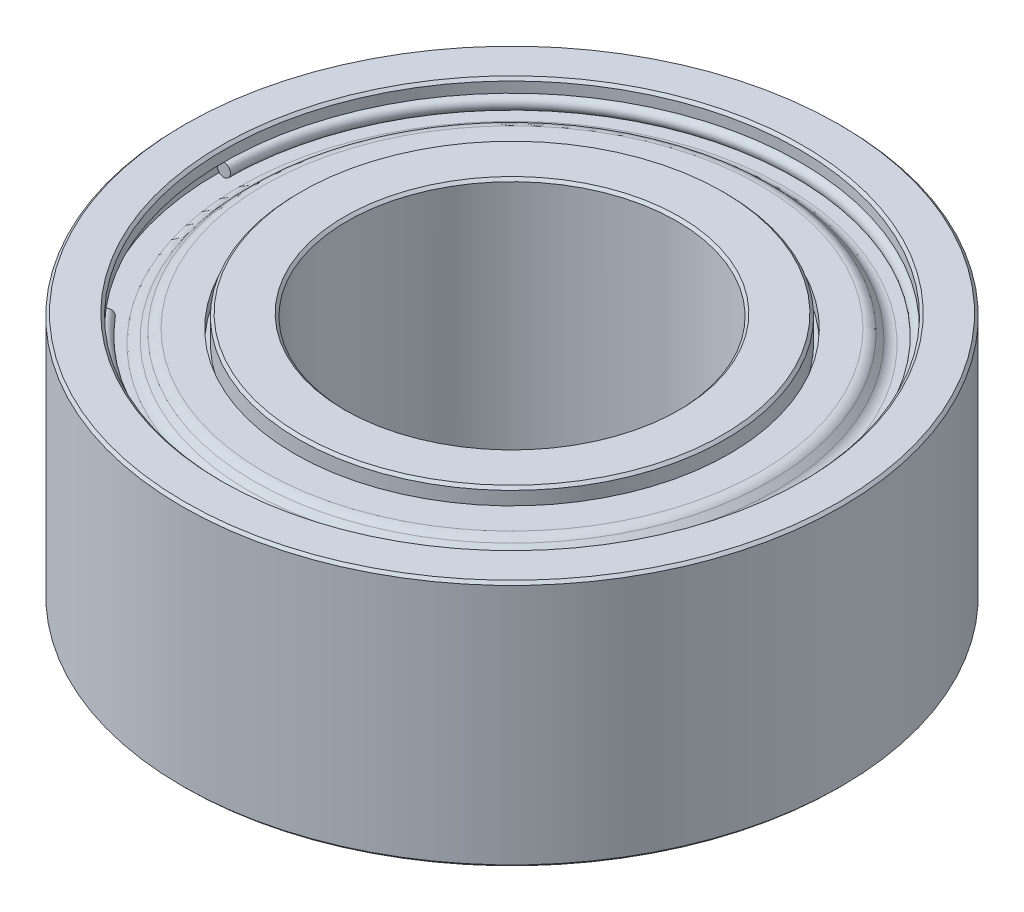
ISO-10303-21;
HEADER;
FILE_DESCRIPTION(('STEP AP214'),'2;1');
FILE_NAME('part.step','',(''),(''),'','','');
FILE_SCHEMA(('AUTOMOTIVE_DESIGN { 1 0 10303 214 1 1 1 1 }'));
ENDSEC;
DATA;
#1=APPLICATION_CONTEXT('core data for automotive mechanical design processes');
#2=APPLICATION_PROTOCOL_DEFINITION('international standard','automotive_design',2000,#1);
#3=PRODUCT_CONTEXT('',#1,'mechanical');
#4=PRODUCT('Part','Part','',(#3));
#5=PRODUCT_RELATED_PRODUCT_CATEGORY('part','',(#4));
#6=PRODUCT_DEFINITION_FORMATION('','',#4);
#7=PRODUCT_DEFINITION_CONTEXT('part definition',#1,'design');
#8=PRODUCT_DEFINITION('design','',#6,#7);
#9=PRODUCT_DEFINITION_SHAPE('','',#8);
#10=(LENGTH_UNIT() NAMED_UNIT(*) SI_UNIT(.MILLI.,.METRE.));
#11=(NAMED_UNIT(*) PLANE_ANGLE_UNIT() SI_UNIT($,.RADIAN.));
#12=(NAMED_UNIT(*) SI_UNIT($,.STERADIAN.) SOLID_ANGLE_UNIT());
#13=UNCERTAINTY_MEASURE_WITH_UNIT(LENGTH_MEASURE(1.E-05),#10,'distance_accuracy_value','');
#14=(GEOMETRIC_REPRESENTATION_CONTEXT(3) GLOBAL_UNCERTAINTY_ASSIGNED_CONTEXT((#13)) GLOBAL_UNIT_ASSIGNED_CONTEXT((#10,
#11,#12)) REPRESENTATION_CONTEXT('',''));
#15=CARTESIAN_POINT('',(0.,0.,0.));
#16=DIRECTION('',(0.,0.,1.));
#17=DIRECTION('',(1.,0.,0.));
#18=AXIS2_PLACEMENT_3D('',#15,#16,#17);
#19=CARTESIAN_POINT('',(0.,0.,0.));
#20=DIRECTION('',(0.,0.,1.));
#21=DIRECTION('',(1.,0.,0.));
#22=AXIS2_PLACEMENT_3D('',#19,#20,#21);
#23=PLANE('',#22);
#24=CARTESIAN_POINT('',(-5.4229,-2.00025,0.));
#25=CARTESIAN_POINT('',(-5.42290899992696,-2.01448035707391,0.));
#26=CARTESIAN_POINT('',(-5.42533449231307,-2.02879828029162,0.));
#27=CARTESIAN_POINT('',(-5.43478379429475,-2.05577713981076,0.));
#28=CARTESIAN_POINT('',(-5.44180760389031,-2.06843807611218,0.));
#29=CARTESIAN_POINT('',(-5.45965126434134,-2.0907338982527,0.));
#30=CARTESIAN_POINT('',(-5.47047111519689,-2.10036878409172,0.));
#31=CARTESIAN_POINT('',(-5.49468979269764,-2.11551068307499,0.));
#32=CARTESIAN_POINT('',(-5.50808861934284,-2.12101769621925,0.));
#33=CARTESIAN_POINT('',(-5.53595386450994,-2.12728686264336,0.));
#34=CARTESIAN_POINT('',(-5.55042028303185,-2.12804901592321,0.));
#35=CARTESIAN_POINT('',(-5.57879001376165,-2.12474255040931,0.));
#36=CARTESIAN_POINT('',(-5.59269332596954,-2.12067393161555,0.));
#37=CARTESIAN_POINT('',(-5.61836899590066,-2.10816068190603,0.));
#38=CARTESIAN_POINT('',(-5.6301413536239,-2.09971605099026,0.));
#39=CARTESIAN_POINT('',(-5.65022901054135,-2.07941861413728,0.));
#40=CARTESIAN_POINT('',(-5.65854430973557,-2.06756580820007,0.));
#41=CARTESIAN_POINT('',(-5.67077615792845,-2.0417292051199,0.));
#42=CARTESIAN_POINT('',(-5.6746927069271,-2.02774540797694,0.));
#43=CARTESIAN_POINT('',(-5.67666833023764,-2.00916030553464,0.));
#44=CARTESIAN_POINT('',(-5.67690282036117,-2.00470945246293,0.));
#45=CARTESIAN_POINT('',(-5.67689100007304,-1.98601964292609,0.));
#46=CARTESIAN_POINT('',(-5.67446550768693,-1.97170171970838,0.));
#47=CARTESIAN_POINT('',(-5.66501620570525,-1.94472286018924,0.));
#48=CARTESIAN_POINT('',(-5.65799239610969,-1.93206192388782,0.));
#49=CARTESIAN_POINT('',(-5.64014873565866,-1.9097661017473,0.));
#50=CARTESIAN_POINT('',(-5.62932888480311,-1.90013121590828,0.));
#51=CARTESIAN_POINT('',(-5.60511020730236,-1.884989316925,0.));
#52=CARTESIAN_POINT('',(-5.59171138065716,-1.87948230378075,0.));
#53=CARTESIAN_POINT('',(-5.56384613549006,-1.87321313735664,0.));
#54=CARTESIAN_POINT('',(-5.54937971696815,-1.87245098407679,0.));
#55=CARTESIAN_POINT('',(-5.52100998623835,-1.87575744959069,0.));
#56=CARTESIAN_POINT('',(-5.50710667403046,-1.87982606838444,0.));
#57=CARTESIAN_POINT('',(-5.48143100409934,-1.89233931809397,0.));
#58=CARTESIAN_POINT('',(-5.4696586463761,-1.90078394900974,0.));
#59=CARTESIAN_POINT('',(-5.44957098945865,-1.92108138586272,0.));
#60=CARTESIAN_POINT('',(-5.44125569026443,-1.93293419179993,0.));
#61=CARTESIAN_POINT('',(-5.42902384207155,-1.9587707948801,0.));
#62=CARTESIAN_POINT('',(-5.4251072930729,-1.97275459202306,0.));
#63=CARTESIAN_POINT('',(-5.42313166976236,-1.99133969446536,0.));
#64=CARTESIAN_POINT('',(-5.42289717963883,-1.99579054753707,0.));
#65=CARTESIAN_POINT('',(-5.4229,-2.00025,0.));
#66=B_SPLINE_CURVE_WITH_KNOTS('',3,(#24,#25,#26,#27,#28,#29,#30,#31,#32,#33,#34,#35,#36,#37,#38,
#39,#40,#41,#42,#43,#44,#45,#46,#47,#48,#49,#50,#51,#52,#53,#54,#55,#56,#57,#58,#59,#60,#61,#62,
#63,#64,#65),.UNSPECIFIED.,.T.,.F.,(4,2,2,2,2,2,2,2,2,2,2,2,2,2,2,2,2,2,2,2,4),(0.,
0.0426429642402333,0.0852859284804666,0.127928892721776,0.170571856963085,0.213214821204395,
0.255857785445704,0.298500749687012,0.341143713928322,0.383786678169631,0.397149959984692,
0.439792924224925,0.482435888465158,0.525078852706467,0.567721816947776,0.610364781189086,
0.653007745430394,0.695650709671705,0.738293673913014,0.780936638154323,0.794299919969383),.UNSPECIFIED.);
#67=CARTESIAN_POINT('',(-5.4229,-2.00025,0.));
#68=VERTEX_POINT('',#67);
#69=EDGE_CURVE('P0_E19',#68,#68,#66,.T.);
#70=ORIENTED_EDGE('',*,*,#69,.F.);
#71=EDGE_LOOP('',(#70));
#72=FACE_BOUND('',#71,.T.);
#73=ADVANCED_FACE('P0_F15',(#72),#23,.T.);
#74=CARTESIAN_POINT('',(0.,0.,0.));
#75=DIRECTION('',(0.64278760968653,0.,0.766044443118986));
#76=DIRECTION('',(0.766044443118986,0.,-0.64278760968653));
#77=AXIS2_PLACEMENT_3D('',#74,#75,#76);
#78=PLANE('',#77);
#79=CARTESIAN_POINT('',(-4.34875769914217,-2.00025,3.64904098142946));
#80=CARTESIAN_POINT('',(-4.34875080479814,-2.01448035707391,3.64903519638793));
#81=CARTESIAN_POINT('',(-4.34689276983393,-2.02879828029162,3.64747611993474));
#82=CARTESIAN_POINT('',(-4.33965418455951,-2.05577713981076,3.64140222570073));
#83=CARTESIAN_POINT('',(-4.3342736342493,-2.06843807611218,3.63688740791991));
#84=CARTESIAN_POINT('',(-4.32060459731589,-2.0907338982527,3.62541772407054));
#85=CARTESIAN_POINT('',(-4.31231611069262,-2.10036878409172,3.61846285800193));
#86=CARTESIAN_POINT('',(-4.29376352737348,-2.11551068307499,3.60289539218145));
#87=CARTESIAN_POINT('',(-4.28349943067761,-2.12101769621925,3.59428279242959));
#88=CARTESIAN_POINT('',(-4.2621534144612,-2.12728686264336,3.57637135809529));
#89=CARTESIAN_POINT('',(-4.25107149494066,-2.12804901592321,3.56707252351287));
#90=CARTESIAN_POINT('',(-4.22933902036231,-2.12474255040931,3.54883681210961));
#91=CARTESIAN_POINT('',(-4.21868846530451,-2.12067393161555,3.53989993528878));
#92=CARTESIAN_POINT('',(-4.19901976103042,-2.10816068190603,3.52339593278665));
#93=CARTESIAN_POINT('',(-4.19000161181413,-2.09971605099026,3.51582880710536));
#94=CARTESIAN_POINT('',(-4.17461357385723,-2.07941861413728,3.50291671013118));
#95=CARTESIAN_POINT('',(-4.16824368511663,-2.06756580820007,3.4975717388383));
#96=CARTESIAN_POINT('',(-4.1588735457794,-2.0417292051199,3.48970925837636));
#97=CARTESIAN_POINT('',(-4.15587329518277,-2.02774540797694,3.48719174920729));
#98=CARTESIAN_POINT('',(-4.15435987992404,-2.00916030553464,3.48592184302187));
#99=CARTESIAN_POINT('',(-4.15418025006795,-2.00470945246293,3.48577111567587));
#100=CARTESIAN_POINT('',(-4.15418930493398,-1.98601964292609,3.48577871361062));
#101=CARTESIAN_POINT('',(-4.15604733989819,-1.97170171970838,3.4873377900638));
#102=CARTESIAN_POINT('',(-4.16328592517261,-1.94472286018924,3.49341168429781));
#103=CARTESIAN_POINT('',(-4.16866647548282,-1.93206192388782,3.49792650207864));
#104=CARTESIAN_POINT('',(-4.18233551241623,-1.9097661017473,3.50939618592801));
#105=CARTESIAN_POINT('',(-4.1906239990395,-1.90013121590828,3.51635105199662));
#106=CARTESIAN_POINT('',(-4.20917658235864,-1.884989316925,3.5319185178171));
#107=CARTESIAN_POINT('',(-4.2194406790545,-1.87948230378075,3.54053111756896));
#108=CARTESIAN_POINT('',(-4.24078669527091,-1.87321313735664,3.55844255190326));
#109=CARTESIAN_POINT('',(-4.25186861479146,-1.87245098407679,3.56774138648568));
#110=CARTESIAN_POINT('',(-4.2736010893698,-1.87575744959069,3.58597709788894));
#111=CARTESIAN_POINT('',(-4.28425164442761,-1.87982606838444,3.59491397470977));
#112=CARTESIAN_POINT('',(-4.3039203487017,-1.89233931809397,3.6114179772119));
#113=CARTESIAN_POINT('',(-4.31293849791799,-1.90078394900974,3.61898510289319));
#114=CARTESIAN_POINT('',(-4.32832653587489,-1.92108138586272,3.63189719986736));
#115=CARTESIAN_POINT('',(-4.33469642461549,-1.93293419179993,3.63724217116024));
#116=CARTESIAN_POINT('',(-4.34406656395272,-1.9587707948801,3.64510465162219));
#117=CARTESIAN_POINT('',(-4.34706681454934,-1.97275459202306,3.64762216079126));
#118=CARTESIAN_POINT('',(-4.34858022980807,-1.99133969446536,3.64889206697668));
#119=CARTESIAN_POINT('',(-4.34875985966417,-1.99579054753707,3.64904279432267));
#120=CARTESIAN_POINT('',(-4.34875769914217,-2.00025,3.64904098142946));
#121=B_SPLINE_CURVE_WITH_KNOTS('',3,(#79,#80,#81,#82,#83,#84,#85,#86,#87,#88,#89,#90,#91,#92,
#93,#94,#95,#96,#97,#98,#99,#100,#101,#102,#103,#104,#105,#106,#107,#108,#109,#110,#111,#112,
#113,#114,#115,#116,#117,#118,#119,#120),.UNSPECIFIED.,.T.,.F.,(4,2,2,2,2,2,2,2,2,2,2,2,2,2,2,2,
2,2,2,2,4),(0.,0.0426429642402328,0.0852859284804664,0.127928892721775,0.170571856963085,
0.213214821204396,0.255857785445703,0.298500749687012,0.341143713928322,0.383786678169631,
0.397149959984692,0.439792924224925,0.482435888465158,0.525078852706467,0.567721816947776,
0.610364781189086,0.653007745430396,0.695650709671705,0.738293673913013,0.780936638154323,
0.794299919969383),.UNSPECIFIED.);
#122=CARTESIAN_POINT('',(-4.34875769914217,-2.00025,3.64904098142946));
#123=VERTEX_POINT('',#122);
#124=EDGE_CURVE('P0_E10',#123,#123,#121,.T.);
#125=ORIENTED_EDGE('',*,*,#124,.F.);
#126=EDGE_LOOP('',(#125));
#127=FACE_BOUND('',#126,.T.);
#128=ADVANCED_FACE('P0_F35',(#127),#78,.F.);
#129=CARTESIAN_POINT('',(0.,-2.00025,0.));
#130=DIRECTION('',(0.,-1.,0.));
#131=DIRECTION('',(0.,0.,1.));
#132=AXIS2_PLACEMENT_3D('',#129,#130,#131);
#133=TOROIDAL_SURFACE('',#132,5.5499,0.127000000000001);
#134=ORIENTED_EDGE('',*,*,#124,.T.);
#135=EDGE_LOOP('',(#134));
#136=FACE_BOUND('',#135,.T.);
#137=ORIENTED_EDGE('',*,*,#69,.T.);
#138=EDGE_LOOP('',(#137));
#139=FACE_BOUND('',#138,.T.);
#140=ADVANCED_FACE('P0_F37',(#136,#139),#133,.T.);
#141=CLOSED_SHELL('',(#73,#128,#140));
#142=MANIFOLD_SOLID_BREP('P0_B1',#141);
#143=CARTESIAN_POINT('',(0.,0.,0.));
#144=DIRECTION('',(0.64278760968653,0.,0.766044443118986));
#145=DIRECTION('',(0.766044443118986,0.,-0.64278760968653));
#146=AXIS2_PLACEMENT_3D('',#143,#144,#145);
#147=PLANE('',#146);
#148=CARTESIAN_POINT('',(-4.15418241058994,2.00025,3.48577292856909));
#149=CARTESIAN_POINT('',(-4.15418930493398,2.01448035707391,3.48577871361062));
#150=CARTESIAN_POINT('',(-4.15604733989819,2.02879828029162,3.48733779006381));
#151=CARTESIAN_POINT('',(-4.16328592517261,2.05577713981076,3.49341168429782));
#152=CARTESIAN_POINT('',(-4.16866647548281,2.06843807611218,3.49792650207864));
#153=CARTESIAN_POINT('',(-4.18233551241622,2.0907338982527,3.50939618592801));
#154=CARTESIAN_POINT('',(-4.1906239990395,2.10036878409172,3.51635105199662));
#155=CARTESIAN_POINT('',(-4.20917658235864,2.11551068307499,3.5319185178171));
#156=CARTESIAN_POINT('',(-4.2194406790545,2.12101769621925,3.54053111756897));
#157=CARTESIAN_POINT('',(-4.24078669527091,2.12728686264336,3.55844255190326));
#158=CARTESIAN_POINT('',(-4.25186861479146,2.12804901592321,3.56774138648568));
#159=CARTESIAN_POINT('',(-4.2736010893698,2.12474255040931,3.58597709788894));
#160=CARTESIAN_POINT('',(-4.2842516444276,2.12067393161555,3.59491397470978));
#161=CARTESIAN_POINT('',(-4.3039203487017,2.10816068190603,3.6114179772119));
#162=CARTESIAN_POINT('',(-4.31293849791799,2.09971605099026,3.61898510289319));
#163=CARTESIAN_POINT('',(-4.32832653587489,2.07941861413728,3.63189719986737));
#164=CARTESIAN_POINT('',(-4.33469642461549,2.06756580820007,3.63724217116025));
#165=CARTESIAN_POINT('',(-4.34406656395272,2.0417292051199,3.64510465162219));
#166=CARTESIAN_POINT('',(-4.34706681454934,2.02774540797693,3.64762216079126));
#167=CARTESIAN_POINT('',(-4.34858022980807,2.00916030553464,3.64889206697668));
#168=CARTESIAN_POINT('',(-4.34875985966417,2.00470945246293,3.64904279432268));
#169=CARTESIAN_POINT('',(-4.34875080479814,1.98601964292609,3.64903519638793));
#170=CARTESIAN_POINT('',(-4.34689276983392,1.97170171970838,3.64747611993475));
#171=CARTESIAN_POINT('',(-4.3396541845595,1.94472286018924,3.64140222570074));
#172=CARTESIAN_POINT('',(-4.3342736342493,1.93206192388782,3.63688740791991));
#173=CARTESIAN_POINT('',(-4.32060459731589,1.9097661017473,3.62541772407054));
#174=CARTESIAN_POINT('',(-4.31231611069261,1.90013121590828,3.61846285800193));
#175=CARTESIAN_POINT('',(-4.29376352737347,1.884989316925,3.60289539218146));
#176=CARTESIAN_POINT('',(-4.28349943067761,1.87948230378075,3.59428279242959));
#177=CARTESIAN_POINT('',(-4.2621534144612,1.87321313735664,3.5763713580953));
#178=CARTESIAN_POINT('',(-4.25107149494066,1.87245098407679,3.56707252351287));
#179=CARTESIAN_POINT('',(-4.22933902036231,1.87575744959069,3.54883681210961));
#180=CARTESIAN_POINT('',(-4.21868846530451,1.87982606838444,3.53989993528878));
#181=CARTESIAN_POINT('',(-4.19901976103042,1.89233931809397,3.52339593278665));
#182=CARTESIAN_POINT('',(-4.19000161181412,1.90078394900974,3.51582880710536));
#183=CARTESIAN_POINT('',(-4.17461357385723,1.92108138586272,3.50291671013119));
#184=CARTESIAN_POINT('',(-4.16824368511663,1.93293419179993,3.49757173883831));
#185=CARTESIAN_POINT('',(-4.1588735457794,1.9587707948801,3.48970925837636));
#186=CARTESIAN_POINT('',(-4.15587329518277,1.97275459202306,3.48719174920729));
#187=CARTESIAN_POINT('',(-4.15435987992404,1.99133969446536,3.48592184302187));
#188=CARTESIAN_POINT('',(-4.15418025006795,1.99579054753707,3.48577111567587));
#189=CARTESIAN_POINT('',(-4.15418241058994,2.00025,3.48577292856909));
#190=B_SPLINE_CURVE_WITH_KNOTS('',3,(#148,#149,#150,#151,#152,#153,#154,#155,#156,#157,#158,
#159,#160,#161,#162,#163,#164,#165,#166,#167,#168,#169,#170,#171,#172,#173,#174,#175,#176,#177,
#178,#179,#180,#181,#182,#183,#184,#185,#186,#187,#188,#189),.UNSPECIFIED.,.T.,.F.,(4,2,2,2,2,2,
2,2,2,2,2,2,2,2,2,2,2,2,2,2,4),(0.,0.0426429642402334,0.0852859284804667,0.127928892721777,
0.170571856963085,0.213214821204394,0.255857785445703,0.298500749687013,0.341143713928323,
0.383786678169631,0.397149959984691,0.439792924224925,0.482435888465158,0.525078852706467,
0.567721816947776,0.610364781189085,0.653007745430396,0.695650709671704,0.738293673913014,
0.780936638154323,0.794299919969383),.UNSPECIFIED.);
#191=CARTESIAN_POINT('',(-4.15418241058994,2.00025,3.48577292856909));
#192=VERTEX_POINT('',#191);
#193=EDGE_CURVE('P1_E19',#192,#192,#190,.T.);
#194=ORIENTED_EDGE('',*,*,#193,.F.);
#195=EDGE_LOOP('',(#194));
#196=FACE_BOUND('',#195,.T.);
#197=ADVANCED_FACE('P1_F15',(#196),#147,.F.);
#198=CARTESIAN_POINT('',(0.,0.,0.));
#199=DIRECTION('',(0.,0.,1.));
#200=DIRECTION('',(1.,0.,0.));
#201=AXIS2_PLACEMENT_3D('',#198,#199,#200);
#202=PLANE('',#201);
#203=CARTESIAN_POINT('',(-5.6769,2.00025,0.));
#204=CARTESIAN_POINT('',(-5.67689100007304,2.01448035707391,0.));
#205=CARTESIAN_POINT('',(-5.67446550768693,2.02879828029162,0.));
#206=CARTESIAN_POINT('',(-5.66501620570525,2.05577713981076,0.));
#207=CARTESIAN_POINT('',(-5.65799239610969,2.06843807611218,0.));
#208=CARTESIAN_POINT('',(-5.64014873565866,2.0907338982527,0.));
#209=CARTESIAN_POINT('',(-5.62932888480311,2.10036878409172,0.));
#210=CARTESIAN_POINT('',(-5.60511020730236,2.11551068307499,0.));
#211=CARTESIAN_POINT('',(-5.59171138065716,2.12101769621925,0.));
#212=CARTESIAN_POINT('',(-5.56384613549006,2.12728686264336,0.));
#213=CARTESIAN_POINT('',(-5.54937971696815,2.12804901592321,0.));
#214=CARTESIAN_POINT('',(-5.52100998623835,2.12474255040931,0.));
#215=CARTESIAN_POINT('',(-5.50710667403046,2.12067393161555,0.));
#216=CARTESIAN_POINT('',(-5.48143100409933,2.10816068190603,0.));
#217=CARTESIAN_POINT('',(-5.4696586463761,2.09971605099026,0.));
#218=CARTESIAN_POINT('',(-5.44957098945865,2.07941861413728,0.));
#219=CARTESIAN_POINT('',(-5.44125569026443,2.06756580820007,0.));
#220=CARTESIAN_POINT('',(-5.42902384207155,2.0417292051199,0.));
#221=CARTESIAN_POINT('',(-5.4251072930729,2.02774540797694,0.));
#222=CARTESIAN_POINT('',(-5.42313166976236,2.00916030553464,0.));
#223=CARTESIAN_POINT('',(-5.42289717963883,2.00470945246293,0.));
#224=CARTESIAN_POINT('',(-5.42290899992696,1.98601964292609,0.));
#225=CARTESIAN_POINT('',(-5.42533449231307,1.97170171970838,0.));
#226=CARTESIAN_POINT('',(-5.43478379429475,1.94472286018924,0.));
#227=CARTESIAN_POINT('',(-5.44180760389031,1.93206192388782,0.));
#228=CARTESIAN_POINT('',(-5.45965126434134,1.9097661017473,0.));
#229=CARTESIAN_POINT('',(-5.47047111519689,1.90013121590828,0.));
#230=CARTESIAN_POINT('',(-5.49468979269764,1.884989316925,0.));
#231=CARTESIAN_POINT('',(-5.50808861934284,1.87948230378075,0.));
#232=CARTESIAN_POINT('',(-5.53595386450994,1.87321313735664,0.));
#233=CARTESIAN_POINT('',(-5.55042028303185,1.87245098407679,0.));
#234=CARTESIAN_POINT('',(-5.57879001376165,1.87575744959069,0.));
#235=CARTESIAN_POINT('',(-5.59269332596954,1.87982606838444,0.));
#236=CARTESIAN_POINT('',(-5.61836899590066,1.89233931809397,0.));
#237=CARTESIAN_POINT('',(-5.6301413536239,1.90078394900974,0.));
#238=CARTESIAN_POINT('',(-5.65022901054135,1.92108138586272,0.));
#239=CARTESIAN_POINT('',(-5.65854430973557,1.93293419179993,0.));
#240=CARTESIAN_POINT('',(-5.67077615792845,1.9587707948801,0.));
#241=CARTESIAN_POINT('',(-5.6746927069271,1.97275459202306,0.));
#242=CARTESIAN_POINT('',(-5.67666833023764,1.99133969446536,0.));
#243=CARTESIAN_POINT('',(-5.67690282036117,1.99579054753707,0.));
#244=CARTESIAN_POINT('',(-5.6769,2.00025,0.));
#245=B_SPLINE_CURVE_WITH_KNOTS('',3,(#203,#204,#205,#206,#207,#208,#209,#210,#211,#212,#213,
#214,#215,#216,#217,#218,#219,#220,#221,#222,#223,#224,#225,#226,#227,#228,#229,#230,#231,#232,
#233,#234,#235,#236,#237,#238,#239,#240,#241,#242,#243,#244),.UNSPECIFIED.,.T.,.F.,(4,2,2,2,2,2,
2,2,2,2,2,2,2,2,2,2,2,2,2,2,4),(0.,0.0426429642402329,0.0852859284804661,0.127928892721774,
0.170571856963085,0.213214821204393,0.255857785445703,0.298500749687013,0.341143713928322,
0.383786678169631,0.397149959984692,0.439792924224925,0.482435888465158,0.525078852706467,
0.567721816947776,0.610364781189086,0.653007745430395,0.695650709671704,0.738293673913013,
0.780936638154323,0.794299919969383),.UNSPECIFIED.);
#246=CARTESIAN_POINT('',(-5.6769,2.00025,0.));
#247=VERTEX_POINT('',#246);
#248=EDGE_CURVE('P1_E10',#247,#247,#245,.T.);
#249=ORIENTED_EDGE('',*,*,#248,.F.);
#250=EDGE_LOOP('',(#249));
#251=FACE_BOUND('',#250,.T.);
#252=ADVANCED_FACE('P1_F37',(#251),#202,.T.);
#253=CARTESIAN_POINT('',(0.,2.00025,0.));
#254=DIRECTION('',(0.,1.,0.));
#255=DIRECTION('',(0.,0.,1.));
#256=AXIS2_PLACEMENT_3D('',#253,#254,#255);
#257=TOROIDAL_SURFACE('',#256,5.5499,0.127000000000001);
#258=ORIENTED_EDGE('',*,*,#248,.T.);
#259=EDGE_LOOP('',(#258));
#260=FACE_BOUND('',#259,.T.);
#261=ORIENTED_EDGE('',*,*,#193,.T.);
#262=EDGE_LOOP('',(#261));
#263=FACE_BOUND('',#262,.T.);
#264=ADVANCED_FACE('P1_F35',(#260,#263),#257,.T.);
#265=CLOSED_SHELL('',(#197,#252,#264));
#266=MANIFOLD_SOLID_BREP('P1_B1',#265);
#267=CARTESIAN_POINT('',(0.,2.38125,0.));
#268=DIRECTION('',(0.,-1.,0.));
#269=DIRECTION('',(0.,0.,-1.));
#270=AXIS2_PLACEMENT_3D('',#267,#268,#269);
#271=CYLINDRICAL_SURFACE('',#270,3.175);
#272=CARTESIAN_POINT('',(0.,-2.33045000004495,0.));
#273=DIRECTION('',(0.,-1.,0.));
#274=DIRECTION('',(0.,0.,-1.));
#275=AXIS2_PLACEMENT_3D('',#272,#273,#274);
#276=CIRCLE('',#275,3.17499999999882);
#277=CARTESIAN_POINT('',(0.,-2.33045000004495,-3.17499999999882));
#278=VERTEX_POINT('',#277);
#279=EDGE_CURVE('P2_E410',#278,#278,#276,.T.);
#280=ORIENTED_EDGE('',*,*,#279,.T.);
#281=EDGE_LOOP('',(#280));
#282=FACE_BOUND('',#281,.T.);
#283=CARTESIAN_POINT('',(0.,2.3304499999881,0.));
#284=DIRECTION('',(0.,1.,0.));
#285=DIRECTION('',(0.,0.,1.));
#286=AXIS2_PLACEMENT_3D('',#283,#284,#285);
#287=CIRCLE('',#286,3.17500000005566);
#288=CARTESIAN_POINT('',(0.,2.3304499999881,3.17500000005566));
#289=VERTEX_POINT('',#288);
#290=EDGE_CURVE('P2_E413',#289,#289,#287,.T.);
#291=ORIENTED_EDGE('',*,*,#290,.T.);
#292=EDGE_LOOP('',(#291));
#293=FACE_BOUND('',#292,.T.);
#294=ADVANCED_FACE('P2_F17',(#282,#293),#271,.F.);
#295=CARTESIAN_POINT('',(0.,2.38124999992806,0.));
#296=DIRECTION('',(0.,1.,0.));
#297=DIRECTION('',(0.,0.,1.));
#298=AXIS2_PLACEMENT_3D('',#295,#296,#297);
#299=CONICAL_SURFACE('',#298,3.22579999999562,0.785398163397448);
#300=ORIENTED_EDGE('',*,*,#290,.F.);
#301=EDGE_LOOP('',(#300));
#302=FACE_BOUND('',#301,.T.);
#303=CARTESIAN_POINT('',(0.,2.38124999992806,0.));
#304=DIRECTION('',(0.,1.,0.));
#305=DIRECTION('',(0.,0.,1.));
#306=AXIS2_PLACEMENT_3D('',#303,#304,#305);
#307=CIRCLE('',#306,3.22579999999562);
#308=CARTESIAN_POINT('',(0.,2.38124999992806,3.22579999999562));
#309=VERTEX_POINT('',#308);
#310=EDGE_CURVE('P2_E408',#309,#309,#307,.F.);
#311=ORIENTED_EDGE('',*,*,#310,.F.);
#312=EDGE_LOOP('',(#311));
#313=FACE_BOUND('',#312,.T.);
#314=ADVANCED_FACE('P2_F186',(#302,#313),#299,.F.);
#315=CARTESIAN_POINT('',(0.,-2.3812499999849,0.));
#316=DIRECTION('',(0.,-1.,0.));
#317=DIRECTION('',(0.,0.,-1.));
#318=AXIS2_PLACEMENT_3D('',#315,#316,#317);
#319=CONICAL_SURFACE('',#318,3.22579999993877,0.785398162837966);
#320=CARTESIAN_POINT('',(0.,-2.3812499999849,0.));
#321=DIRECTION('',(0.,-1.,0.));
#322=DIRECTION('',(0.,0.,-1.));
#323=AXIS2_PLACEMENT_3D('',#320,#321,#322);
#324=CIRCLE('',#323,3.22579999993877);
#325=CARTESIAN_POINT('',(0.,-2.3812499999849,-3.22579999993877));
#326=VERTEX_POINT('',#325);
#327=EDGE_CURVE('P2_E406',#326,#326,#324,.T.);
#328=ORIENTED_EDGE('',*,*,#327,.T.);
#329=EDGE_LOOP('',(#328));
#330=FACE_BOUND('',#329,.T.);
#331=ORIENTED_EDGE('',*,*,#279,.F.);
#332=EDGE_LOOP('',(#331));
#333=FACE_BOUND('',#332,.T.);
#334=ADVANCED_FACE('P2_F183',(#330,#333),#319,.F.);
#335=CARTESIAN_POINT('',(0.,2.38125,0.));
#336=DIRECTION('',(0.,1.,0.));
#337=DIRECTION('',(0.,0.,1.));
#338=AXIS2_PLACEMENT_3D('',#335,#336,#337);
#339=PLANE('',#338);
#340=ORIENTED_EDGE('',*,*,#310,.T.);
#341=EDGE_LOOP('',(#340));
#342=FACE_BOUND('',#341,.T.);
#343=CARTESIAN_POINT('',(0.,2.3812499999849,0.));
#344=DIRECTION('',(0.,-1.,0.));
#345=DIRECTION('',(0.,0.,-1.));
#346=AXIS2_PLACEMENT_3D('',#343,#344,#345);
#347=CIRCLE('',#346,4.05764999999292);
#348=CARTESIAN_POINT('',(0.,2.3812499999849,-4.05764999999292));
#349=VERTEX_POINT('',#348);
#350=EDGE_CURVE('P2_E403',#349,#349,#347,.T.);
#351=ORIENTED_EDGE('',*,*,#350,.F.);
#352=EDGE_LOOP('',(#351));
#353=FACE_BOUND('',#352,.T.);
#354=ADVANCED_FACE('P2_F179',(#342,#353),#339,.T.);
#355=CARTESIAN_POINT('',(0.,-2.38125,0.));
#356=DIRECTION('',(0.,1.,0.));
#357=DIRECTION('',(0.,0.,1.));
#358=AXIS2_PLACEMENT_3D('',#355,#356,#357);
#359=PLANE('',#358);
#360=CARTESIAN_POINT('',(0.,-2.38125000004175,0.));
#361=DIRECTION('',(0.,1.,0.));
#362=DIRECTION('',(0.,0.,1.));
#363=AXIS2_PLACEMENT_3D('',#360,#361,#362);
#364=CIRCLE('',#363,4.05764999993607);
#365=CARTESIAN_POINT('',(0.,-2.38125000004175,4.05764999993607));
#366=VERTEX_POINT('',#365);
#367=EDGE_CURVE('P2_E399',#366,#366,#364,.T.);
#368=ORIENTED_EDGE('',*,*,#367,.F.);
#369=EDGE_LOOP('',(#368));
#370=FACE_BOUND('',#369,.T.);
#371=ORIENTED_EDGE('',*,*,#327,.F.);
#372=EDGE_LOOP('',(#371));
#373=FACE_BOUND('',#372,.T.);
#374=ADVANCED_FACE('P2_F175',(#370,#373),#359,.F.);
#375=CARTESIAN_POINT('',(0.,2.33044999987442,0.));
#376=DIRECTION('',(0.,-1.,0.));
#377=DIRECTION('',(0.,0.,-1.));
#378=AXIS2_PLACEMENT_3D('',#375,#376,#377);
#379=CONICAL_SURFACE('',#378,4.1084500001034,0.785398163397448);
#380=ORIENTED_EDGE('',*,*,#350,.T.);
#381=EDGE_LOOP('',(#380));
#382=FACE_BOUND('',#381,.T.);
#383=CARTESIAN_POINT('',(0.,2.33045,0.));
#384=DIRECTION('',(0.,1.,0.));
#385=DIRECTION('',(0.,0.,1.));
#386=AXIS2_PLACEMENT_3D('',#383,#384,#385);
#387=CIRCLE('',#386,4.10845);
#388=CARTESIAN_POINT('',(0.,2.33045,4.10845));
#389=VERTEX_POINT('',#388);
#390=EDGE_CURVE('P2_E402',#389,#389,#387,.F.);
#391=ORIENTED_EDGE('',*,*,#390,.F.);
#392=EDGE_LOOP('',(#391));
#393=FACE_BOUND('',#392,.T.);
#394=ADVANCED_FACE('P2_F171',(#382,#393),#379,.T.);
#395=CARTESIAN_POINT('',(0.,-2.3304499999881,0.));
#396=DIRECTION('',(0.,1.,0.));
#397=DIRECTION('',(0.,0.,1.));
#398=AXIS2_PLACEMENT_3D('',#395,#396,#397);
#399=CONICAL_SURFACE('',#398,4.10844999998972,0.785398163397448);
#400=CARTESIAN_POINT('',(0.,-2.33045,0.));
#401=DIRECTION('',(0.,-1.,0.));
#402=DIRECTION('',(0.,0.,-1.));
#403=AXIS2_PLACEMENT_3D('',#400,#401,#402);
#404=CIRCLE('',#403,4.10845);
#405=CARTESIAN_POINT('',(0.,-2.33045,-4.10845));
#406=VERTEX_POINT('',#405);
#407=EDGE_CURVE('P2_E79',#406,#406,#404,.F.);
#408=ORIENTED_EDGE('',*,*,#407,.F.);
#409=EDGE_LOOP('',(#408));
#410=FACE_BOUND('',#409,.T.);
#411=ORIENTED_EDGE('',*,*,#367,.T.);
#412=EDGE_LOOP('',(#411));
#413=FACE_BOUND('',#412,.T.);
#414=ADVANCED_FACE('P2_F167',(#410,#413),#399,.T.);
#415=CARTESIAN_POINT('',(0.,2.12725,0.));
#416=DIRECTION('',(0.,1.,0.));
#417=DIRECTION('',(0.,0.,1.));
#418=AXIS2_PLACEMENT_3D('',#415,#416,#417);
#419=CYLINDRICAL_SURFACE('',#418,4.10845);
#420=CARTESIAN_POINT('',(0.,1.87325,0.));
#421=DIRECTION('',(0.,1.,0.));
#422=DIRECTION('',(0.,0.,1.));
#423=AXIS2_PLACEMENT_3D('',#420,#421,#422);
#424=CIRCLE('',#423,4.10845);
#425=CARTESIAN_POINT('',(0.,1.87325,4.10845));
#426=VERTEX_POINT('',#425);
#427=EDGE_CURVE('P2_E396',#426,#426,#424,.F.);
#428=ORIENTED_EDGE('',*,*,#427,.F.);
#429=EDGE_LOOP('',(#428));
#430=FACE_BOUND('',#429,.T.);
#431=ORIENTED_EDGE('',*,*,#390,.T.);
#432=EDGE_LOOP('',(#431));
#433=FACE_BOUND('',#432,.T.);
#434=ADVANCED_FACE('P2_F163',(#430,#433),#419,.T.);
#435=CARTESIAN_POINT('',(0.,-2.12725,0.));
#436=DIRECTION('',(0.,-1.,0.));
#437=DIRECTION('',(0.,0.,-1.));
#438=AXIS2_PLACEMENT_3D('',#435,#436,#437);
#439=CYLINDRICAL_SURFACE('',#438,4.10845);
#440=ORIENTED_EDGE('',*,*,#407,.T.);
#441=EDGE_LOOP('',(#440));
#442=FACE_BOUND('',#441,.T.);
#443=CARTESIAN_POINT('',(0.,-1.87325,0.));
#444=DIRECTION('',(0.,-1.,0.));
#445=DIRECTION('',(0.,0.,-1.));
#446=AXIS2_PLACEMENT_3D('',#443,#444,#445);
#447=CIRCLE('',#446,4.10845);
#448=CARTESIAN_POINT('',(0.,-1.87325,-4.10845));
#449=VERTEX_POINT('',#448);
#450=EDGE_CURVE('P2_E393',#449,#449,#447,.F.);
#451=ORIENTED_EDGE('',*,*,#450,.F.);
#452=EDGE_LOOP('',(#451));
#453=FACE_BOUND('',#452,.T.);
#454=ADVANCED_FACE('P2_F159',(#442,#453),#439,.T.);
#455=CARTESIAN_POINT('',(0.,1.87325,0.));
#456=DIRECTION('',(0.,1.,0.));
#457=DIRECTION('',(0.,0.,1.));
#458=AXIS2_PLACEMENT_3D('',#455,#456,#457);
#459=PLANE('',#458);
#460=CARTESIAN_POINT('',(0.,1.87325,0.));
#461=DIRECTION('',(0.,1.,0.));
#462=DIRECTION('',(0.,0.,1.));
#463=AXIS2_PLACEMENT_3D('',#460,#461,#462);
#464=CIRCLE('',#463,4.1855922886146);
#465=CARTESIAN_POINT('',(0.,1.87325,4.1855922886146));
#466=VERTEX_POINT('',#465);
#467=EDGE_CURVE('P2_E390',#466,#466,#464,.T.);
#468=ORIENTED_EDGE('',*,*,#467,.T.);
#469=EDGE_LOOP('',(#468));
#470=FACE_BOUND('',#469,.T.);
#471=ORIENTED_EDGE('',*,*,#427,.T.);
#472=EDGE_LOOP('',(#471));
#473=FACE_BOUND('',#472,.T.);
#474=ADVANCED_FACE('P2_F155',(#470,#473),#459,.T.);
#475=CARTESIAN_POINT('',(0.,-1.87325,0.));
#476=DIRECTION('',(0.,-1.,0.));
#477=DIRECTION('',(0.,0.,-1.));
#478=AXIS2_PLACEMENT_3D('',#475,#476,#477);
#479=PLANE('',#478);
#480=ORIENTED_EDGE('',*,*,#450,.T.);
#481=EDGE_LOOP('',(#480));
#482=FACE_BOUND('',#481,.T.);
#483=CARTESIAN_POINT('',(0.,-1.87325,0.));
#484=DIRECTION('',(0.,-1.,0.));
#485=DIRECTION('',(0.,0.,-1.));
#486=AXIS2_PLACEMENT_3D('',#483,#484,#485);
#487=CIRCLE('',#486,4.1855922886146);
#488=CARTESIAN_POINT('',(0.,-1.87325,-4.1855922886146));
#489=VERTEX_POINT('',#488);
#490=EDGE_CURVE('P2_E387',#489,#489,#487,.T.);
#491=ORIENTED_EDGE('',*,*,#490,.T.);
#492=EDGE_LOOP('',(#491));
#493=FACE_BOUND('',#492,.T.);
#494=ADVANCED_FACE('P2_F151',(#482,#493),#479,.T.);
#495=CARTESIAN_POINT('',(0.,1.87325,0.));
#496=DIRECTION('',(0.,1.,0.));
#497=DIRECTION('',(0.,0.,1.));
#498=AXIS2_PLACEMENT_3D('',#495,#496,#497);
#499=CYLINDRICAL_SURFACE('',#498,4.1855922886146);
#500=CARTESIAN_POINT('',(0.,2.12725,0.));
#501=DIRECTION('',(0.,1.,0.));
#502=DIRECTION('',(0.,0.,1.));
#503=AXIS2_PLACEMENT_3D('',#500,#501,#502);
#504=CIRCLE('',#503,4.1855922886146);
#505=CARTESIAN_POINT('',(0.,2.12725,4.1855922886146));
#506=VERTEX_POINT('',#505);
#507=EDGE_CURVE('P2_E384',#506,#506,#504,.F.);
#508=ORIENTED_EDGE('',*,*,#507,.F.);
#509=EDGE_LOOP('',(#508));
#510=FACE_BOUND('',#509,.T.);
#511=ORIENTED_EDGE('',*,*,#467,.F.);
#512=EDGE_LOOP('',(#511));
#513=FACE_BOUND('',#512,.T.);
#514=ADVANCED_FACE('P2_F147',(#510,#513),#499,.F.);
#515=CARTESIAN_POINT('',(0.,-1.87325,0.));
#516=DIRECTION('',(0.,-1.,0.));
#517=DIRECTION('',(0.,0.,-1.));
#518=AXIS2_PLACEMENT_3D('',#515,#516,#517);
#519=CYLINDRICAL_SURFACE('',#518,4.1855922886146);
#520=ORIENTED_EDGE('',*,*,#490,.F.);
#521=EDGE_LOOP('',(#520));
#522=FACE_BOUND('',#521,.T.);
#523=CARTESIAN_POINT('',(0.,-2.12725,0.));
#524=DIRECTION('',(0.,-1.,0.));
#525=DIRECTION('',(0.,0.,-1.));
#526=AXIS2_PLACEMENT_3D('',#523,#524,#525);
#527=CIRCLE('',#526,4.1855922886146);
#528=CARTESIAN_POINT('',(0.,-2.12725,-4.1855922886146));
#529=VERTEX_POINT('',#528);
#530=EDGE_CURVE('P2_E65',#529,#529,#527,.F.);
#531=ORIENTED_EDGE('',*,*,#530,.F.);
#532=EDGE_LOOP('',(#531));
#533=FACE_BOUND('',#532,.T.);
#534=ADVANCED_FACE('P2_F143',(#522,#533),#519,.F.);
#535=CARTESIAN_POINT('',(0.,2.12725,0.));
#536=DIRECTION('',(0.,1.,0.));
#537=DIRECTION('',(0.,0.,1.));
#538=AXIS2_PLACEMENT_3D('',#535,#536,#537);
#539=PLANE('',#538);
#540=CARTESIAN_POINT('',(0.,2.12725,0.));
#541=DIRECTION('',(0.,-1.,0.));
#542=DIRECTION('',(0.,0.,-1.));
#543=AXIS2_PLACEMENT_3D('',#540,#541,#542);
#544=CIRCLE('',#543,4.7801495690683);
#545=CARTESIAN_POINT('',(0.,2.12725,-4.7801495690683));
#546=VERTEX_POINT('',#545);
#547=CARTESIAN_POINT('',(0.,2.12725,4.7801495690683));
#548=VERTEX_POINT('',#547);
#549=EDGE_CURVE('P2_E63',#546,#548,#544,.T.);
#550=ORIENTED_EDGE('',*,*,#549,.F.);
#551=CARTESIAN_POINT('',(0.,2.12725,0.));
#552=DIRECTION('',(0.,-1.,0.));
#553=DIRECTION('',(0.,0.,1.));
#554=AXIS2_PLACEMENT_3D('',#551,#552,#553);
#555=CIRCLE('',#554,4.7801495690683);
#556=EDGE_CURVE('P2_E57',#548,#546,#555,.T.);
#557=ORIENTED_EDGE('',*,*,#556,.F.);
#558=EDGE_LOOP('',(#550,#557));
#559=FACE_BOUND('',#558,.T.);
#560=ORIENTED_EDGE('',*,*,#507,.T.);
#561=EDGE_LOOP('',(#560));
#562=FACE_BOUND('',#561,.T.);
#563=ADVANCED_FACE('P2_F61',(#559,#562),#539,.T.);
#564=CARTESIAN_POINT('',(0.,-2.12725,0.));
#565=DIRECTION('',(0.,-1.,0.));
#566=DIRECTION('',(0.,0.,-1.));
#567=AXIS2_PLACEMENT_3D('',#564,#565,#566);
#568=PLANE('',#567);
#569=ORIENTED_EDGE('',*,*,#530,.T.);
#570=EDGE_LOOP('',(#569));
#571=FACE_BOUND('',#570,.T.);
#572=CARTESIAN_POINT('',(0.,-2.12725,0.));
#573=DIRECTION('',(0.,1.,0.));
#574=DIRECTION('',(0.,0.,1.));
#575=AXIS2_PLACEMENT_3D('',#572,#573,#574);
#576=CIRCLE('',#575,4.7801495690683);
#577=CARTESIAN_POINT('',(0.,-2.12725,4.7801495690683));
#578=VERTEX_POINT('',#577);
#579=CARTESIAN_POINT('',(0.,-2.12725,-4.7801495690683));
#580=VERTEX_POINT('',#579);
#581=EDGE_CURVE('P2_E106',#578,#580,#576,.T.);
#582=ORIENTED_EDGE('',*,*,#581,.F.);
#583=CARTESIAN_POINT('',(0.,-2.12725,0.));
#584=DIRECTION('',(0.,1.,0.));
#585=DIRECTION('',(0.,0.,-1.));
#586=AXIS2_PLACEMENT_3D('',#583,#584,#585);
#587=CIRCLE('',#586,4.7801495690683);
#588=EDGE_CURVE('P2_E71',#580,#578,#587,.T.);
#589=ORIENTED_EDGE('',*,*,#588,.F.);
#590=EDGE_LOOP('',(#582,#589));
#591=FACE_BOUND('',#590,.T.);
#592=ADVANCED_FACE('P2_F92',(#571,#591),#568,.T.);
#593=CARTESIAN_POINT('',(0.,1.87325,0.));
#594=DIRECTION('',(0.,1.,0.));
#595=DIRECTION('',(0.,0.,1.));
#596=AXIS2_PLACEMENT_3D('',#593,#594,#595);
#597=TOROIDAL_SURFACE('',#596,4.7801495690683,0.254);
#598=ORIENTED_EDGE('',*,*,#556,.T.);
#599=ORIENTED_EDGE('',*,*,#549,.T.);
#600=EDGE_LOOP('',(#598,#599));
#601=FACE_BOUND('',#600,.T.);
#602=CARTESIAN_POINT('',(0.,2.05285512237197,0.));
#603=DIRECTION('',(0.,-1.,0.));
#604=DIRECTION('',(0.,0.,-1.));
#605=AXIS2_PLACEMENT_3D('',#602,#603,#604);
#606=CIRCLE('',#605,4.9597546914697);
#607=CARTESIAN_POINT('',(0.,2.05285512237197,-4.9597546914697));
#608=VERTEX_POINT('',#607);
#609=EDGE_CURVE('P2_E101',#608,#608,#606,.T.);
#610=ORIENTED_EDGE('',*,*,#609,.F.);
#611=EDGE_LOOP('',(#610));
#612=FACE_BOUND('',#611,.T.);
#613=ADVANCED_FACE('P2_F69',(#601,#612),#597,.T.);
#614=CARTESIAN_POINT('',(0.,-1.87325,0.));
#615=DIRECTION('',(0.,-1.,0.));
#616=DIRECTION('',(0.,0.,-1.));
#617=AXIS2_PLACEMENT_3D('',#614,#615,#616);
#618=TOROIDAL_SURFACE('',#617,4.7801495690683,0.254);
#619=ORIENTED_EDGE('',*,*,#588,.T.);
#620=ORIENTED_EDGE('',*,*,#581,.T.);
#621=EDGE_LOOP('',(#619,#620));
#622=FACE_BOUND('',#621,.T.);
#623=CARTESIAN_POINT('',(0.,-2.05285512242881,0.));
#624=DIRECTION('',(0.,1.,0.));
#625=DIRECTION('',(0.,0.,1.));
#626=AXIS2_PLACEMENT_3D('',#623,#624,#625);
#627=CIRCLE('',#626,4.95975469152654);
#628=CARTESIAN_POINT('',(0.,-2.05285512242881,4.95975469152654));
#629=VERTEX_POINT('',#628);
#630=EDGE_CURVE('P2_E345',#629,#629,#627,.T.);
#631=ORIENTED_EDGE('',*,*,#630,.F.);
#632=EDGE_LOOP('',(#631));
#633=FACE_BOUND('',#632,.T.);
#634=ADVANCED_FACE('P2_F91',(#622,#633),#618,.T.);
#635=CARTESIAN_POINT('',(0.,1.94764487764587,0.));
#636=DIRECTION('',(0.,-1.,0.));
#637=DIRECTION('',(1.,0.,0.));
#638=AXIS2_PLACEMENT_3D('',#635,#636,#637);
#639=CONICAL_SURFACE('',#638,5.06496493625264,0.785398163397448);
#640=CARTESIAN_POINT('',(0.,1.94764487757862,0.));
#641=DIRECTION('',(0.,1.,0.));
#642=DIRECTION('',(0.,0.,1.));
#643=AXIS2_PLACEMENT_3D('',#640,#641,#642);
#644=CIRCLE('',#643,5.06496493633244);
#645=CARTESIAN_POINT('',(0.,1.94764487757862,5.06496493633244));
#646=VERTEX_POINT('',#645);
#647=EDGE_CURVE('P2_E349',#646,#646,#644,.T.);
#648=ORIENTED_EDGE('',*,*,#647,.T.);
#649=EDGE_LOOP('',(#648));
#650=FACE_BOUND('',#649,.T.);
#651=ORIENTED_EDGE('',*,*,#609,.T.);
#652=EDGE_LOOP('',(#651));
#653=FACE_BOUND('',#652,.T.);
#654=ADVANCED_FACE('P2_F505',(#650,#653),#639,.T.);
#655=CARTESIAN_POINT('',(0.,-1.94764487764587,0.));
#656=DIRECTION('',(0.,1.,0.));
#657=DIRECTION('',(-1.,0.,0.));
#658=AXIS2_PLACEMENT_3D('',#655,#656,#657);
#659=CONICAL_SURFACE('',#658,5.06496493630948,0.785398163397448);
#660=CARTESIAN_POINT('',(0.,-1.94764487757862,0.));
#661=DIRECTION('',(0.,-1.,0.));
#662=DIRECTION('',(0.,0.,-1.));
#663=AXIS2_PLACEMENT_3D('',#660,#661,#662);
#664=CIRCLE('',#663,5.06496493633245);
#665=CARTESIAN_POINT('',(0.,-1.94764487757862,-5.06496493633245));
#666=VERTEX_POINT('',#665);
#667=EDGE_CURVE('P2_E354',#666,#666,#664,.T.);
#668=ORIENTED_EDGE('',*,*,#667,.T.);
#669=EDGE_LOOP('',(#668));
#670=FACE_BOUND('',#669,.T.);
#671=ORIENTED_EDGE('',*,*,#630,.T.);
#672=EDGE_LOOP('',(#671));
#673=FACE_BOUND('',#672,.T.);
#674=ADVANCED_FACE('P2_F511',(#670,#673),#659,.T.);
#675=CARTESIAN_POINT('',(0.,2.12725,0.));
#676=DIRECTION('',(0.,1.,0.));
#677=DIRECTION('',(0.,0.,1.));
#678=AXIS2_PLACEMENT_3D('',#675,#676,#677);
#679=TOROIDAL_SURFACE('',#678,5.24457005875383,0.254);
#680=ORIENTED_EDGE('',*,*,#647,.F.);
#681=EDGE_LOOP('',(#680));
#682=FACE_BOUND('',#681,.T.);
#683=CARTESIAN_POINT('',(0.,1.87325,0.));
#684=DIRECTION('',(0.,1.,0.));
#685=DIRECTION('',(0.,0.,-1.));
#686=AXIS2_PLACEMENT_3D('',#683,#684,#685);
#687=CIRCLE('',#686,5.24457005875383);
#688=CARTESIAN_POINT('',(0.,1.87325,5.24457005875383));
#689=VERTEX_POINT('',#688);
#690=CARTESIAN_POINT('',(0.,1.87325,-5.24457005875383));
#691=VERTEX_POINT('',#690);
#692=EDGE_CURVE('P2_E281',#689,#691,#687,.F.);
#693=ORIENTED_EDGE('',*,*,#692,.F.);
#694=CARTESIAN_POINT('',(0.,1.87325,0.));
#695=DIRECTION('',(0.,1.,0.));
#696=DIRECTION('',(0.,0.,1.));
#697=AXIS2_PLACEMENT_3D('',#694,#695,#696);
#698=CIRCLE('',#697,5.24457005875383);
#699=EDGE_CURVE('P2_E291',#691,#689,#698,.F.);
#700=ORIENTED_EDGE('',*,*,#699,.F.);
#701=EDGE_LOOP('',(#693,#700));
#702=FACE_BOUND('',#701,.T.);
#703=ADVANCED_FACE('P2_F306',(#682,#702),#679,.F.);
#704=CARTESIAN_POINT('',(0.,-2.12725,0.));
#705=DIRECTION('',(0.,-1.,0.));
#706=DIRECTION('',(0.,0.,-1.));
#707=AXIS2_PLACEMENT_3D('',#704,#705,#706);
#708=TOROIDAL_SURFACE('',#707,5.24457005875383,0.254);
#709=ORIENTED_EDGE('',*,*,#667,.F.);
#710=EDGE_LOOP('',(#709));
#711=FACE_BOUND('',#710,.T.);
#712=CARTESIAN_POINT('',(0.,-1.87325,0.));
#713=DIRECTION('',(0.,-1.,0.));
#714=DIRECTION('',(0.,0.,1.));
#715=AXIS2_PLACEMENT_3D('',#712,#713,#714);
#716=CIRCLE('',#715,5.24457005875383);
#717=CARTESIAN_POINT('',(0.,-1.87325,-5.24457005875383));
#718=VERTEX_POINT('',#717);
#719=CARTESIAN_POINT('',(0.,-1.87325,5.24457005875383));
#720=VERTEX_POINT('',#719);
#721=EDGE_CURVE('P2_E369',#718,#720,#716,.F.);
#722=ORIENTED_EDGE('',*,*,#721,.F.);
#723=CARTESIAN_POINT('',(0.,-1.87325,0.));
#724=DIRECTION('',(0.,-1.,0.));
#725=DIRECTION('',(0.,0.,-1.));
#726=AXIS2_PLACEMENT_3D('',#723,#724,#725);
#727=CIRCLE('',#726,5.24457005875383);
#728=EDGE_CURVE('P2_E36',#720,#718,#727,.F.);
#729=ORIENTED_EDGE('',*,*,#728,.F.);
#730=EDGE_LOOP('',(#722,#729));
#731=FACE_BOUND('',#730,.T.);
#732=ADVANCED_FACE('P2_F302',(#711,#731),#708,.F.);
#733=CARTESIAN_POINT('',(0.,1.87325,0.));
#734=DIRECTION('',(0.,1.,0.));
#735=DIRECTION('',(0.,0.,1.));
#736=AXIS2_PLACEMENT_3D('',#733,#734,#735);
#737=PLANE('',#736);
#738=ORIENTED_EDGE('',*,*,#692,.T.);
#739=ORIENTED_EDGE('',*,*,#699,.T.);
#740=EDGE_LOOP('',(#738,#739));
#741=FACE_BOUND('',#740,.T.);
#742=CARTESIAN_POINT('',(0.,1.87325,0.));
#743=DIRECTION('',(0.,1.,0.));
#744=DIRECTION('',(0.,0.,1.));
#745=AXIS2_PLACEMENT_3D('',#742,#743,#744);
#746=CIRCLE('',#745,5.6769);
#747=CARTESIAN_POINT('',(0.,1.87325,5.6769));
#748=VERTEX_POINT('',#747);
#749=EDGE_CURVE('P2_E371',#748,#748,#746,.T.);
#750=ORIENTED_EDGE('',*,*,#749,.T.);
#751=EDGE_LOOP('',(#750));
#752=FACE_BOUND('',#751,.T.);
#753=ADVANCED_FACE('P2_F258',(#741,#752),#737,.T.);
#754=CARTESIAN_POINT('',(0.,-1.87325,0.));
#755=DIRECTION('',(0.,-1.,0.));
#756=DIRECTION('',(0.,0.,-1.));
#757=AXIS2_PLACEMENT_3D('',#754,#755,#756);
#758=PLANE('',#757);
#759=CARTESIAN_POINT('',(0.,-1.87325,0.));
#760=DIRECTION('',(0.,-1.,0.));
#761=DIRECTION('',(0.,0.,-1.));
#762=AXIS2_PLACEMENT_3D('',#759,#760,#761);
#763=CIRCLE('',#762,5.6769);
#764=CARTESIAN_POINT('',(0.,-1.87325,-5.6769));
#765=VERTEX_POINT('',#764);
#766=EDGE_CURVE('P2_E373',#765,#765,#763,.T.);
#767=ORIENTED_EDGE('',*,*,#766,.T.);
#768=EDGE_LOOP('',(#767));
#769=FACE_BOUND('',#768,.T.);
#770=ORIENTED_EDGE('',*,*,#721,.T.);
#771=ORIENTED_EDGE('',*,*,#728,.T.);
#772=EDGE_LOOP('',(#770,#771));
#773=FACE_BOUND('',#772,.T.);
#774=ADVANCED_FACE('P2_F253',(#769,#773),#758,.T.);
#775=CARTESIAN_POINT('',(0.,1.87325,0.));
#776=DIRECTION('',(0.,1.,0.));
#777=DIRECTION('',(0.,0.,1.));
#778=AXIS2_PLACEMENT_3D('',#775,#776,#777);
#779=CYLINDRICAL_SURFACE('',#778,5.6769);
#780=ORIENTED_EDGE('',*,*,#749,.F.);
#781=EDGE_LOOP('',(#780));
#782=FACE_BOUND('',#781,.T.);
#783=CARTESIAN_POINT('',(0.,2.12725,0.));
#784=DIRECTION('',(0.,1.,0.));
#785=DIRECTION('',(0.,0.,1.));
#786=AXIS2_PLACEMENT_3D('',#783,#784,#785);
#787=CIRCLE('',#786,5.6769);
#788=CARTESIAN_POINT('',(0.,2.12725,5.6769));
#789=VERTEX_POINT('',#788);
#790=EDGE_CURVE('P2_E378',#789,#789,#787,.T.);
#791=ORIENTED_EDGE('',*,*,#790,.T.);
#792=EDGE_LOOP('',(#791));
#793=FACE_BOUND('',#792,.T.);
#794=ADVANCED_FACE('P2_F249',(#782,#793),#779,.F.);
#795=CARTESIAN_POINT('',(0.,-1.87325,0.));
#796=DIRECTION('',(0.,-1.,0.));
#797=DIRECTION('',(0.,0.,-1.));
#798=AXIS2_PLACEMENT_3D('',#795,#796,#797);
#799=CYLINDRICAL_SURFACE('',#798,5.6769);
#800=CARTESIAN_POINT('',(0.,-2.12725,0.));
#801=DIRECTION('',(0.,-1.,0.));
#802=DIRECTION('',(0.,0.,-1.));
#803=AXIS2_PLACEMENT_3D('',#800,#801,#802);
#804=CIRCLE('',#803,5.6769);
#805=CARTESIAN_POINT('',(0.,-2.12725,-5.6769));
#806=VERTEX_POINT('',#805);
#807=EDGE_CURVE('P2_E439',#806,#806,#804,.T.);
#808=ORIENTED_EDGE('',*,*,#807,.T.);
#809=EDGE_LOOP('',(#808));
#810=FACE_BOUND('',#809,.T.);
#811=ORIENTED_EDGE('',*,*,#766,.F.);
#812=EDGE_LOOP('',(#811));
#813=FACE_BOUND('',#812,.T.);
#814=ADVANCED_FACE('P2_F245',(#810,#813),#799,.F.);
#815=CARTESIAN_POINT('',(0.,2.12725,0.));
#816=DIRECTION('',(0.,1.,0.));
#817=DIRECTION('',(0.,0.,1.));
#818=AXIS2_PLACEMENT_3D('',#815,#816,#817);
#819=PLANE('',#818);
#820=CARTESIAN_POINT('',(0.,2.12725,0.));
#821=DIRECTION('',(0.,1.,0.));
#822=DIRECTION('',(0.,0.,1.));
#823=AXIS2_PLACEMENT_3D('',#820,#821,#822);
#824=CIRCLE('',#823,5.5499);
#825=CARTESIAN_POINT('',(0.,2.12725,5.5499));
#826=VERTEX_POINT('',#825);
#827=EDGE_CURVE('P2_E436',#826,#826,#824,.T.);
#828=ORIENTED_EDGE('',*,*,#827,.T.);
#829=EDGE_LOOP('',(#828));
#830=FACE_BOUND('',#829,.T.);
#831=ORIENTED_EDGE('',*,*,#790,.F.);
#832=EDGE_LOOP('',(#831));
#833=FACE_BOUND('',#832,.T.);
#834=ADVANCED_FACE('P2_F241',(#830,#833),#819,.F.);
#835=CARTESIAN_POINT('',(0.,-2.12725,0.));
#836=DIRECTION('',(0.,-1.,0.));
#837=DIRECTION('',(0.,0.,-1.));
#838=AXIS2_PLACEMENT_3D('',#835,#836,#837);
#839=PLANE('',#838);
#840=ORIENTED_EDGE('',*,*,#807,.F.);
#841=EDGE_LOOP('',(#840));
#842=FACE_BOUND('',#841,.T.);
#843=CARTESIAN_POINT('',(0.,-2.12725,0.));
#844=DIRECTION('',(0.,-1.,0.));
#845=DIRECTION('',(0.,0.,-1.));
#846=AXIS2_PLACEMENT_3D('',#843,#844,#845);
#847=CIRCLE('',#846,5.5499);
#848=CARTESIAN_POINT('',(0.,-2.12725,-5.5499));
#849=VERTEX_POINT('',#848);
#850=EDGE_CURVE('P2_E432',#849,#849,#847,.T.);
#851=ORIENTED_EDGE('',*,*,#850,.T.);
#852=EDGE_LOOP('',(#851));
#853=FACE_BOUND('',#852,.T.);
#854=ADVANCED_FACE('P2_F237',(#842,#853),#839,.F.);
#855=CARTESIAN_POINT('',(0.,2.12725,0.));
#856=DIRECTION('',(0.,1.,0.));
#857=DIRECTION('',(0.,0.,1.));
#858=AXIS2_PLACEMENT_3D('',#855,#856,#857);
#859=CYLINDRICAL_SURFACE('',#858,5.5499);
#860=ORIENTED_EDGE('',*,*,#827,.F.);
#861=EDGE_LOOP('',(#860));
#862=FACE_BOUND('',#861,.T.);
#863=CARTESIAN_POINT('',(0.,2.3304499999881,0.));
#864=DIRECTION('',(0.,1.,0.));
#865=DIRECTION('',(0.,0.,1.));
#866=AXIS2_PLACEMENT_3D('',#863,#864,#865);
#867=CIRCLE('',#866,5.54990000000544);
#868=CARTESIAN_POINT('',(0.,2.3304499999881,5.54990000000544));
#869=VERTEX_POINT('',#868);
#870=EDGE_CURVE('P2_E435',#869,#869,#867,.T.);
#871=ORIENTED_EDGE('',*,*,#870,.T.);
#872=EDGE_LOOP('',(#871));
#873=FACE_BOUND('',#872,.T.);
#874=ADVANCED_FACE('P2_F233',(#862,#873),#859,.F.);
#875=CARTESIAN_POINT('',(0.,-2.12725,0.));
#876=DIRECTION('',(0.,-1.,0.));
#877=DIRECTION('',(0.,0.,-1.));
#878=AXIS2_PLACEMENT_3D('',#875,#876,#877);
#879=CYLINDRICAL_SURFACE('',#878,5.5499);
#880=CARTESIAN_POINT('',(0.,-2.33045000004495,0.));
#881=DIRECTION('',(0.,-1.,0.));
#882=DIRECTION('',(0.,0.,-1.));
#883=AXIS2_PLACEMENT_3D('',#880,#881,#882);
#884=CIRCLE('',#883,5.54990000006228);
#885=CARTESIAN_POINT('',(0.,-2.33045000004495,-5.54990000006228));
#886=VERTEX_POINT('',#885);
#887=EDGE_CURVE('P2_E431',#886,#886,#884,.T.);
#888=ORIENTED_EDGE('',*,*,#887,.T.);
#889=EDGE_LOOP('',(#888));
#890=FACE_BOUND('',#889,.T.);
#891=ORIENTED_EDGE('',*,*,#850,.F.);
#892=EDGE_LOOP('',(#891));
#893=FACE_BOUND('',#892,.T.);
#894=ADVANCED_FACE('P2_F229',(#890,#893),#879,.F.);
#895=CARTESIAN_POINT('',(0.,2.38124999981437,0.));
#896=DIRECTION('',(0.,1.,0.));
#897=DIRECTION('',(0.,0.,1.));
#898=AXIS2_PLACEMENT_3D('',#895,#896,#897);
#899=CONICAL_SURFACE('',#898,5.6006999998317,0.785398163397448);
#900=ORIENTED_EDGE('',*,*,#870,.F.);
#901=EDGE_LOOP('',(#900));
#902=FACE_BOUND('',#901,.T.);
#903=CARTESIAN_POINT('',(0.,2.38124999992806,0.));
#904=DIRECTION('',(0.,1.,0.));
#905=DIRECTION('',(0.,0.,1.));
#906=AXIS2_PLACEMENT_3D('',#903,#904,#905);
#907=CIRCLE('',#906,5.60069999994539);
#908=CARTESIAN_POINT('',(0.,2.38124999992806,5.60069999994539));
#909=VERTEX_POINT('',#908);
#910=EDGE_CURVE('P2_E428',#909,#909,#907,.F.);
#911=ORIENTED_EDGE('',*,*,#910,.F.);
#912=EDGE_LOOP('',(#911));
#913=FACE_BOUND('',#912,.T.);
#914=ADVANCED_FACE('P2_F225',(#902,#913),#899,.F.);
#915=CARTESIAN_POINT('',(0.,-2.38124999981437,0.));
#916=DIRECTION('',(0.,-1.,0.));
#917=DIRECTION('',(0.,0.,-1.));
#918=AXIS2_PLACEMENT_3D('',#915,#916,#917);
#919=CONICAL_SURFACE('',#918,5.6006999998317,0.785398163397448);
#920=CARTESIAN_POINT('',(0.,-2.3812499999849,0.));
#921=DIRECTION('',(0.,-1.,0.));
#922=DIRECTION('',(0.,0.,-1.));
#923=AXIS2_PLACEMENT_3D('',#920,#921,#922);
#924=CIRCLE('',#923,5.60070000000223);
#925=CARTESIAN_POINT('',(0.,-2.3812499999849,-5.60070000000223));
#926=VERTEX_POINT('',#925);
#927=EDGE_CURVE('P2_E425',#926,#926,#924,.T.);
#928=ORIENTED_EDGE('',*,*,#927,.T.);
#929=EDGE_LOOP('',(#928));
#930=FACE_BOUND('',#929,.T.);
#931=ORIENTED_EDGE('',*,*,#887,.F.);
#932=EDGE_LOOP('',(#931));
#933=FACE_BOUND('',#932,.T.);
#934=ADVANCED_FACE('P2_F221',(#930,#933),#919,.F.);
#935=CARTESIAN_POINT('',(0.,2.38125,0.));
#936=DIRECTION('',(0.,1.,0.));
#937=DIRECTION('',(0.,0.,1.));
#938=AXIS2_PLACEMENT_3D('',#935,#936,#937);
#939=PLANE('',#938);
#940=ORIENTED_EDGE('',*,*,#910,.T.);
#941=EDGE_LOOP('',(#940));
#942=FACE_BOUND('',#941,.T.);
#943=CARTESIAN_POINT('',(0.,2.3812499999849,0.));
#944=DIRECTION('',(0.,-1.,0.));
#945=DIRECTION('',(0.,0.,-1.));
#946=AXIS2_PLACEMENT_3D('',#943,#944,#945);
#947=CIRCLE('',#946,6.29920000000084);
#948=CARTESIAN_POINT('',(0.,2.3812499999849,-6.29920000000084));
#949=VERTEX_POINT('',#948);
#950=EDGE_CURVE('P2_E422',#949,#949,#947,.T.);
#951=ORIENTED_EDGE('',*,*,#950,.F.);
#952=EDGE_LOOP('',(#951));
#953=FACE_BOUND('',#952,.T.);
#954=ADVANCED_FACE('P2_F217',(#942,#953),#939,.T.);
#955=CARTESIAN_POINT('',(0.,-2.38125,0.));
#956=DIRECTION('',(0.,1.,0.));
#957=DIRECTION('',(0.,0.,1.));
#958=AXIS2_PLACEMENT_3D('',#955,#956,#957);
#959=PLANE('',#958);
#960=CARTESIAN_POINT('',(0.,-2.3812499999849,0.));
#961=DIRECTION('',(0.,1.,0.));
#962=DIRECTION('',(0.,0.,1.));
#963=AXIS2_PLACEMENT_3D('',#960,#961,#962);
#964=CIRCLE('',#963,6.29920000000084);
#965=CARTESIAN_POINT('',(0.,-2.3812499999849,6.29920000000084));
#966=VERTEX_POINT('',#965);
#967=EDGE_CURVE('P2_E419',#966,#966,#964,.T.);
#968=ORIENTED_EDGE('',*,*,#967,.F.);
#969=EDGE_LOOP('',(#968));
#970=FACE_BOUND('',#969,.T.);
#971=ORIENTED_EDGE('',*,*,#927,.F.);
#972=EDGE_LOOP('',(#971));
#973=FACE_BOUND('',#972,.T.);
#974=ADVANCED_FACE('P2_F213',(#970,#973),#959,.F.);
#975=CARTESIAN_POINT('',(0.,2.33045000010179,0.));
#976=DIRECTION('',(0.,-1.,0.));
#977=DIRECTION('',(0.,0.,-1.));
#978=AXIS2_PLACEMENT_3D('',#975,#976,#977);
#979=CONICAL_SURFACE('',#978,6.34999999988395,0.785398163397448);
#980=ORIENTED_EDGE('',*,*,#950,.T.);
#981=EDGE_LOOP('',(#980));
#982=FACE_BOUND('',#981,.T.);
#983=CARTESIAN_POINT('',(0.,2.33045000000001,0.));
#984=DIRECTION('',(0.,-1.,0.));
#985=DIRECTION('',(0.,0.,-1.));
#986=AXIS2_PLACEMENT_3D('',#983,#984,#985);
#987=CIRCLE('',#986,6.35);
#988=CARTESIAN_POINT('',(0.,2.33045000000001,-6.35));
#989=VERTEX_POINT('',#988);
#990=EDGE_CURVE('P2_E28',#989,#989,#987,.T.);
#991=ORIENTED_EDGE('',*,*,#990,.F.);
#992=EDGE_LOOP('',(#991));
#993=FACE_BOUND('',#992,.T.);
#994=ADVANCED_FACE('P2_F205',(#982,#993),#979,.T.);
#995=CARTESIAN_POINT('',(0.,-2.33045000010179,0.));
#996=DIRECTION('',(0.,1.,0.));
#997=DIRECTION('',(0.,0.,1.));
#998=AXIS2_PLACEMENT_3D('',#995,#996,#997);
#999=CONICAL_SURFACE('',#998,6.34999999988395,0.785398163397448);
#1000=CARTESIAN_POINT('',(0.,-2.33044999999999,0.));
#1001=DIRECTION('',(0.,-1.,0.));
#1002=DIRECTION('',(0.,0.,-1.));
#1003=AXIS2_PLACEMENT_3D('',#1000,#1001,#1002);
#1004=CIRCLE('',#1003,6.35);
#1005=CARTESIAN_POINT('',(0.,-2.33044999999999,-6.35));
#1006=VERTEX_POINT('',#1005);
#1007=EDGE_CURVE('P2_E11',#1006,#1006,#1004,.F.);
#1008=ORIENTED_EDGE('',*,*,#1007,.F.);
#1009=EDGE_LOOP('',(#1008));
#1010=FACE_BOUND('',#1009,.T.);
#1011=ORIENTED_EDGE('',*,*,#967,.T.);
#1012=EDGE_LOOP('',(#1011));
#1013=FACE_BOUND('',#1012,.T.);
#1014=ADVANCED_FACE('P2_F199',(#1010,#1013),#999,.T.);
#1015=CARTESIAN_POINT('',(0.,2.38125,0.));
#1016=DIRECTION('',(0.,-1.,0.));
#1017=DIRECTION('',(0.,0.,-1.));
#1018=AXIS2_PLACEMENT_3D('',#1015,#1016,#1017);
#1019=CYLINDRICAL_SURFACE('',#1018,6.35);
#1020=ORIENTED_EDGE('',*,*,#990,.T.);
#1021=EDGE_LOOP('',(#1020));
#1022=FACE_BOUND('',#1021,.T.);
#1023=ORIENTED_EDGE('',*,*,#1007,.T.);
#1024=EDGE_LOOP('',(#1023));
#1025=FACE_BOUND('',#1024,.T.);
#1026=ADVANCED_FACE('P2_F197',(#1022,#1025),#1019,.T.);
#1027=CLOSED_SHELL('',(#294,#314,#334,#354,#374,#394,#414,#434,#454,#474,#494,#514,#534,#563,
#592,#613,#634,#654,#674,#703,#732,#753,#774,#794,#814,#834,#854,#874,#894,#914,#934,#954,#974,
#994,#1014,#1026));
#1028=MANIFOLD_SOLID_BREP('P2_B1',#1027);
#1029=ADVANCED_BREP_SHAPE_REPRESENTATION('',(#18,#142,#266,#1028),#14);
#1030=SHAPE_DEFINITION_REPRESENTATION(#9,#1029);
ENDSEC;
END-ISO-10303-21;
